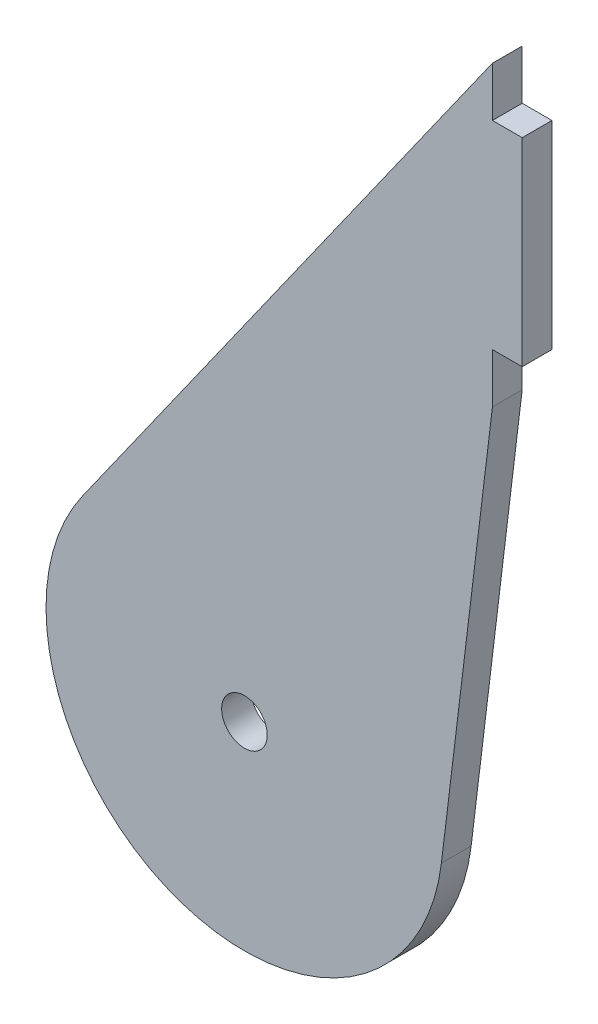
ISO-10303-21;
HEADER;
FILE_DESCRIPTION(('STEP AP214'),'2;1');
FILE_NAME('part.step','',(''),(''),'','','');
FILE_SCHEMA(('AUTOMOTIVE_DESIGN { 1 0 10303 214 1 1 1 1 }'));
ENDSEC;
DATA;
#1=APPLICATION_CONTEXT('core data for automotive mechanical design processes');
#2=APPLICATION_PROTOCOL_DEFINITION('international standard','automotive_design',2000,#1);
#3=PRODUCT_CONTEXT('',#1,'mechanical');
#4=PRODUCT('Part','Part','',(#3));
#5=PRODUCT_RELATED_PRODUCT_CATEGORY('part','',(#4));
#6=PRODUCT_DEFINITION_FORMATION('','',#4);
#7=PRODUCT_DEFINITION_CONTEXT('part definition',#1,'design');
#8=PRODUCT_DEFINITION('design','',#6,#7);
#9=PRODUCT_DEFINITION_SHAPE('','',#8);
#10=(LENGTH_UNIT() NAMED_UNIT(*) SI_UNIT(.MILLI.,.METRE.));
#11=(NAMED_UNIT(*) PLANE_ANGLE_UNIT() SI_UNIT($,.RADIAN.));
#12=(NAMED_UNIT(*) SI_UNIT($,.STERADIAN.) SOLID_ANGLE_UNIT());
#13=UNCERTAINTY_MEASURE_WITH_UNIT(LENGTH_MEASURE(1.E-05),#10,'distance_accuracy_value','');
#14=(GEOMETRIC_REPRESENTATION_CONTEXT(3) GLOBAL_UNCERTAINTY_ASSIGNED_CONTEXT((#13)) GLOBAL_UNIT_ASSIGNED_CONTEXT((#10,
#11,#12)) REPRESENTATION_CONTEXT('',''));
#15=CARTESIAN_POINT('',(0.,0.,0.));
#16=DIRECTION('',(0.,0.,1.));
#17=DIRECTION('',(1.,0.,0.));
#18=AXIS2_PLACEMENT_3D('',#15,#16,#17);
#19=CARTESIAN_POINT('',(25.,70.,-3.));
#20=DIRECTION('',(1.,0.,0.));
#21=DIRECTION('',(0.,1.,0.));
#22=AXIS2_PLACEMENT_3D('',#19,#20,#21);
#23=PLANE('',#22);
#24=DIRECTION('',(0.,0.,1.));
#25=VECTOR('',#24,1.);
#26=CARTESIAN_POINT('',(25.,65.,0.));
#27=LINE('',#26,#25);
#28=CARTESIAN_POINT('',(25.,65.,-3.));
#29=VERTEX_POINT('',#28);
#30=CARTESIAN_POINT('',(25.,65.,0.));
#31=VERTEX_POINT('',#30);
#32=EDGE_CURVE('E49',#29,#31,#27,.T.);
#33=ORIENTED_EDGE('',*,*,#32,.F.);
#34=DIRECTION('',(0.,1.,0.));
#35=VECTOR('',#34,1.);
#36=CARTESIAN_POINT('',(25.,70.,-3.));
#37=LINE('',#36,#35);
#38=CARTESIAN_POINT('',(25.,70.,-3.));
#39=VERTEX_POINT('',#38);
#40=EDGE_CURVE('E155',#29,#39,#37,.T.);
#41=ORIENTED_EDGE('',*,*,#40,.T.);
#42=DIRECTION('',(0.,0.,1.));
#43=VECTOR('',#42,1.);
#44=CARTESIAN_POINT('',(25.,70.,-3.));
#45=LINE('',#44,#43);
#46=CARTESIAN_POINT('',(25.,70.,0.));
#47=VERTEX_POINT('',#46);
#48=EDGE_CURVE('E41',#39,#47,#45,.T.);
#49=ORIENTED_EDGE('',*,*,#48,.T.);
#50=DIRECTION('',(0.,1.,0.));
#51=VECTOR('',#50,1.);
#52=CARTESIAN_POINT('',(25.,70.,0.));
#53=LINE('',#52,#51);
#54=EDGE_CURVE('E54',#31,#47,#53,.T.);
#55=ORIENTED_EDGE('',*,*,#54,.F.);
#56=EDGE_LOOP('',(#33,#41,#49,#55));
#57=FACE_BOUND('',#56,.T.);
#58=ADVANCED_FACE('F32',(#57),#23,.T.);
#59=CARTESIAN_POINT('',(0.,0.,-3.));
#60=DIRECTION('',(0.,0.,1.));
#61=DIRECTION('',(1.,0.,0.));
#62=AXIS2_PLACEMENT_3D('',#59,#60,#61);
#63=CYLINDRICAL_SURFACE('',#62,20.);
#64=CARTESIAN_POINT('',(0.,0.,0.));
#65=DIRECTION('',(0.,0.,1.));
#66=DIRECTION('',(1.,0.,0.));
#67=AXIS2_PLACEMENT_3D('',#64,#65,#66);
#68=CIRCLE('',#67,20.);
#69=CARTESIAN_POINT('',(-16.3302710303954,11.5465253679983,0.));
#70=VERTEX_POINT('',#69);
#71=CARTESIAN_POINT('',(19.854388755627,-2.40899297226689,0.));
#72=VERTEX_POINT('',#71);
#73=EDGE_CURVE('E147',#70,#72,#68,.T.);
#74=ORIENTED_EDGE('',*,*,#73,.F.);
#75=DIRECTION('',(0.,0.,1.));
#76=VECTOR('',#75,1.);
#77=CARTESIAN_POINT('',(-16.3302710303954,11.5465253679983,-3.));
#78=LINE('',#77,#76);
#79=CARTESIAN_POINT('',(-16.3302710303954,11.5465253679983,-3.));
#80=VERTEX_POINT('',#79);
#81=EDGE_CURVE('E11',#80,#70,#78,.T.);
#82=ORIENTED_EDGE('',*,*,#81,.F.);
#83=CARTESIAN_POINT('',(0.,0.,-3.));
#84=DIRECTION('',(0.,0.,1.));
#85=DIRECTION('',(1.,0.,0.));
#86=AXIS2_PLACEMENT_3D('',#83,#84,#85);
#87=CIRCLE('',#86,20.);
#88=CARTESIAN_POINT('',(19.854388755627,-2.40899297226689,-3.));
#89=VERTEX_POINT('',#88);
#90=EDGE_CURVE('E148',#80,#89,#87,.T.);
#91=ORIENTED_EDGE('',*,*,#90,.T.);
#92=DIRECTION('',(0.,0.,1.));
#93=VECTOR('',#92,1.);
#94=CARTESIAN_POINT('',(19.854388755627,-2.40899297226689,-3.));
#95=LINE('',#94,#93);
#96=EDGE_CURVE('E178',#89,#72,#95,.T.);
#97=ORIENTED_EDGE('',*,*,#96,.T.);
#98=EDGE_LOOP('',(#74,#82,#91,#97));
#99=FACE_BOUND('',#98,.T.);
#100=ADVANCED_FACE('F34',(#99),#63,.T.);
#101=CARTESIAN_POINT('',(-16.3302710303954,11.5465253679983,-3.));
#102=DIRECTION('',(-0.816513551519769,0.577326268399917,0.));
#103=DIRECTION('',(-0.577326268399917,-0.816513551519769,0.));
#104=AXIS2_PLACEMENT_3D('',#101,#102,#103);
#105=PLANE('',#104);
#106=DIRECTION('',(-0.577326268399917,-0.816513551519769,0.));
#107=VECTOR('',#106,1.);
#108=CARTESIAN_POINT('',(-16.3302710303954,11.5465253679983,0.));
#109=LINE('',#108,#107);
#110=EDGE_CURVE('E152',#47,#70,#109,.T.);
#111=ORIENTED_EDGE('',*,*,#110,.F.);
#112=ORIENTED_EDGE('',*,*,#48,.F.);
#113=DIRECTION('',(-0.577326268399917,-0.816513551519769,0.));
#114=VECTOR('',#113,1.);
#115=CARTESIAN_POINT('',(-16.3302710303954,11.5465253679983,-3.));
#116=LINE('',#115,#114);
#117=EDGE_CURVE('E158',#39,#80,#116,.T.);
#118=ORIENTED_EDGE('',*,*,#117,.T.);
#119=ORIENTED_EDGE('',*,*,#81,.T.);
#120=EDGE_LOOP('',(#111,#112,#118,#119));
#121=FACE_BOUND('',#120,.T.);
#122=ADVANCED_FACE('F187',(#121),#105,.T.);
#123=DIRECTION('',(0.,0.,-1.));
#124=VECTOR('',#123,1.);
#125=CARTESIAN_POINT('',(25.,45.,0.));
#126=LINE('',#125,#124);
#127=CARTESIAN_POINT('',(25.,45.,0.));
#128=VERTEX_POINT('',#127);
#129=CARTESIAN_POINT('',(25.,45.,-3.));
#130=VERTEX_POINT('',#129);
#131=EDGE_CURVE('E137',#128,#130,#126,.T.);
#132=ORIENTED_EDGE('',*,*,#131,.F.);
#133=CARTESIAN_POINT('',(25.,40.,0.));
#134=VERTEX_POINT('',#133);
#135=EDGE_CURVE('E122',#134,#128,#53,.T.);
#136=ORIENTED_EDGE('',*,*,#135,.F.);
#137=DIRECTION('',(0.,0.,1.));
#138=VECTOR('',#137,1.);
#139=CARTESIAN_POINT('',(25.,40.,-3.));
#140=LINE('',#139,#138);
#141=CARTESIAN_POINT('',(25.,40.,-3.));
#142=VERTEX_POINT('',#141);
#143=EDGE_CURVE('E177',#142,#134,#140,.T.);
#144=ORIENTED_EDGE('',*,*,#143,.F.);
#145=EDGE_CURVE('E164',#142,#130,#37,.T.);
#146=ORIENTED_EDGE('',*,*,#145,.T.);
#147=EDGE_LOOP('',(#132,#136,#144,#146));
#148=FACE_BOUND('',#147,.T.);
#149=ADVANCED_FACE('F197',(#148),#23,.T.);
#150=CARTESIAN_POINT('',(25.,40.,-3.));
#151=DIRECTION('',(0.992719437781351,-0.120449648613344,0.));
#152=DIRECTION('',(0.120449648613344,0.992719437781351,0.));
#153=AXIS2_PLACEMENT_3D('',#150,#151,#152);
#154=PLANE('',#153);
#155=DIRECTION('',(0.120449648613344,0.992719437781351,0.));
#156=VECTOR('',#155,1.);
#157=CARTESIAN_POINT('',(25.,40.,0.));
#158=LINE('',#157,#156);
#159=EDGE_CURVE('E168',#72,#134,#158,.T.);
#160=ORIENTED_EDGE('',*,*,#159,.F.);
#161=ORIENTED_EDGE('',*,*,#96,.F.);
#162=DIRECTION('',(0.120449648613344,0.992719437781351,0.));
#163=VECTOR('',#162,1.);
#164=CARTESIAN_POINT('',(25.,40.,-3.));
#165=LINE('',#164,#163);
#166=EDGE_CURVE('E151',#89,#142,#165,.T.);
#167=ORIENTED_EDGE('',*,*,#166,.T.);
#168=ORIENTED_EDGE('',*,*,#143,.T.);
#169=EDGE_LOOP('',(#160,#161,#167,#168));
#170=FACE_BOUND('',#169,.T.);
#171=ADVANCED_FACE('F203',(#170),#154,.T.);
#172=CARTESIAN_POINT('',(0.,0.,-3.));
#173=DIRECTION('',(0.,0.,1.));
#174=DIRECTION('',(1.,0.,0.));
#175=AXIS2_PLACEMENT_3D('',#172,#173,#174);
#176=PLANE('',#175);
#177=CARTESIAN_POINT('',(0.,0.,-3.));
#178=DIRECTION('',(0.,0.,1.));
#179=DIRECTION('',(1.,0.,0.));
#180=AXIS2_PLACEMENT_3D('',#177,#178,#179);
#181=CIRCLE('',#180,2.3);
#182=CARTESIAN_POINT('',(2.3,0.,-3.));
#183=VERTEX_POINT('',#182);
#184=EDGE_CURVE('E126',#183,#183,#181,.T.);
#185=ORIENTED_EDGE('',*,*,#184,.T.);
#186=EDGE_LOOP('',(#185));
#187=FACE_BOUND('',#186,.T.);
#188=ORIENTED_EDGE('',*,*,#90,.F.);
#189=ORIENTED_EDGE('',*,*,#117,.F.);
#190=ORIENTED_EDGE('',*,*,#40,.F.);
#191=DIRECTION('',(-1.,0.,0.));
#192=VECTOR('',#191,1.);
#193=CARTESIAN_POINT('',(28.,65.,-3.));
#194=LINE('',#193,#192);
#195=CARTESIAN_POINT('',(28.,65.,-3.));
#196=VERTEX_POINT('',#195);
#197=EDGE_CURVE('E128',#196,#29,#194,.T.);
#198=ORIENTED_EDGE('',*,*,#197,.F.);
#199=DIRECTION('',(0.,1.,0.));
#200=VECTOR('',#199,1.);
#201=CARTESIAN_POINT('',(28.,65.,-3.));
#202=LINE('',#201,#200);
#203=CARTESIAN_POINT('',(28.,45.,-3.));
#204=VERTEX_POINT('',#203);
#205=EDGE_CURVE('E106',#204,#196,#202,.T.);
#206=ORIENTED_EDGE('',*,*,#205,.F.);
#207=DIRECTION('',(-1.,0.,0.));
#208=VECTOR('',#207,1.);
#209=CARTESIAN_POINT('',(28.,45.,-3.));
#210=LINE('',#209,#208);
#211=EDGE_CURVE('E103',#204,#130,#210,.T.);
#212=ORIENTED_EDGE('',*,*,#211,.T.);
#213=ORIENTED_EDGE('',*,*,#145,.F.);
#214=ORIENTED_EDGE('',*,*,#166,.F.);
#215=EDGE_LOOP('',(#188,#189,#190,#198,#206,#212,#213,#214));
#216=FACE_BOUND('',#215,.T.);
#217=ADVANCED_FACE('F190',(#187,#216),#176,.F.);
#218=CARTESIAN_POINT('',(0.,0.,0.));
#219=DIRECTION('',(0.,0.,1.));
#220=DIRECTION('',(1.,0.,0.));
#221=AXIS2_PLACEMENT_3D('',#218,#219,#220);
#222=PLANE('',#221);
#223=CARTESIAN_POINT('',(0.,0.,0.));
#224=DIRECTION('',(0.,0.,1.));
#225=DIRECTION('',(1.,0.,0.));
#226=AXIS2_PLACEMENT_3D('',#223,#224,#225);
#227=CIRCLE('',#226,2.3);
#228=CARTESIAN_POINT('',(2.3,0.,0.));
#229=VERTEX_POINT('',#228);
#230=EDGE_CURVE('E123',#229,#229,#227,.T.);
#231=ORIENTED_EDGE('',*,*,#230,.F.);
#232=EDGE_LOOP('',(#231));
#233=FACE_BOUND('',#232,.T.);
#234=ORIENTED_EDGE('',*,*,#73,.T.);
#235=ORIENTED_EDGE('',*,*,#159,.T.);
#236=ORIENTED_EDGE('',*,*,#135,.T.);
#237=DIRECTION('',(-1.,0.,0.));
#238=VECTOR('',#237,1.);
#239=CARTESIAN_POINT('',(28.,45.,0.));
#240=LINE('',#239,#238);
#241=CARTESIAN_POINT('',(28.,45.,0.));
#242=VERTEX_POINT('',#241);
#243=EDGE_CURVE('E101',#242,#128,#240,.T.);
#244=ORIENTED_EDGE('',*,*,#243,.F.);
#245=DIRECTION('',(0.,-1.,0.));
#246=VECTOR('',#245,1.);
#247=CARTESIAN_POINT('',(28.,65.,0.));
#248=LINE('',#247,#246);
#249=CARTESIAN_POINT('',(28.,65.,0.));
#250=VERTEX_POINT('',#249);
#251=EDGE_CURVE('E107',#250,#242,#248,.T.);
#252=ORIENTED_EDGE('',*,*,#251,.F.);
#253=DIRECTION('',(-1.,0.,0.));
#254=VECTOR('',#253,1.);
#255=CARTESIAN_POINT('',(28.,65.,0.));
#256=LINE('',#255,#254);
#257=EDGE_CURVE('E138',#250,#31,#256,.T.);
#258=ORIENTED_EDGE('',*,*,#257,.T.);
#259=ORIENTED_EDGE('',*,*,#54,.T.);
#260=ORIENTED_EDGE('',*,*,#110,.T.);
#261=EDGE_LOOP('',(#234,#235,#236,#244,#252,#258,#259,#260));
#262=FACE_BOUND('',#261,.T.);
#263=ADVANCED_FACE('F119',(#233,#262),#222,.T.);
#264=CARTESIAN_POINT('',(0.,0.,-10.));
#265=DIRECTION('',(0.,0.,1.));
#266=DIRECTION('',(1.,0.,0.));
#267=AXIS2_PLACEMENT_3D('',#264,#265,#266);
#268=CYLINDRICAL_SURFACE('',#267,2.3);
#269=ORIENTED_EDGE('',*,*,#230,.T.);
#270=EDGE_LOOP('',(#269));
#271=FACE_BOUND('',#270,.T.);
#272=ORIENTED_EDGE('',*,*,#184,.F.);
#273=EDGE_LOOP('',(#272));
#274=FACE_BOUND('',#273,.T.);
#275=ADVANCED_FACE('F221',(#271,#274),#268,.F.);
#276=CARTESIAN_POINT('',(28.,45.,0.));
#277=DIRECTION('',(0.,1.,0.));
#278=DIRECTION('',(-1.,0.,0.));
#279=AXIS2_PLACEMENT_3D('',#276,#277,#278);
#280=PLANE('',#279);
#281=ORIENTED_EDGE('',*,*,#131,.T.);
#282=ORIENTED_EDGE('',*,*,#211,.F.);
#283=DIRECTION('',(0.,0.,-1.));
#284=VECTOR('',#283,1.);
#285=CARTESIAN_POINT('',(28.,45.,0.));
#286=LINE('',#285,#284);
#287=EDGE_CURVE('E96',#242,#204,#286,.T.);
#288=ORIENTED_EDGE('',*,*,#287,.F.);
#289=ORIENTED_EDGE('',*,*,#243,.T.);
#290=EDGE_LOOP('',(#281,#282,#288,#289));
#291=FACE_BOUND('',#290,.T.);
#292=ADVANCED_FACE('F99',(#291),#280,.F.);
#293=CARTESIAN_POINT('',(28.,65.,0.));
#294=DIRECTION('',(0.,-1.,0.));
#295=DIRECTION('',(1.,0.,0.));
#296=AXIS2_PLACEMENT_3D('',#293,#294,#295);
#297=PLANE('',#296);
#298=ORIENTED_EDGE('',*,*,#32,.T.);
#299=ORIENTED_EDGE('',*,*,#257,.F.);
#300=DIRECTION('',(0.,0.,1.));
#301=VECTOR('',#300,1.);
#302=CARTESIAN_POINT('',(28.,65.,0.));
#303=LINE('',#302,#301);
#304=EDGE_CURVE('E112',#196,#250,#303,.T.);
#305=ORIENTED_EDGE('',*,*,#304,.F.);
#306=ORIENTED_EDGE('',*,*,#197,.T.);
#307=EDGE_LOOP('',(#298,#299,#305,#306));
#308=FACE_BOUND('',#307,.T.);
#309=ADVANCED_FACE('F213',(#308),#297,.F.);
#310=CARTESIAN_POINT('',(28.,0.,0.));
#311=DIRECTION('',(1.,0.,0.));
#312=DIRECTION('',(0.,1.,0.));
#313=AXIS2_PLACEMENT_3D('',#310,#311,#312);
#314=PLANE('',#313);
#315=ORIENTED_EDGE('',*,*,#251,.T.);
#316=ORIENTED_EDGE('',*,*,#287,.T.);
#317=ORIENTED_EDGE('',*,*,#205,.T.);
#318=ORIENTED_EDGE('',*,*,#304,.T.);
#319=EDGE_LOOP('',(#315,#316,#317,#318));
#320=FACE_BOUND('',#319,.T.);
#321=ADVANCED_FACE('F110',(#320),#314,.T.);
#322=CLOSED_SHELL('',(#58,#100,#122,#149,#171,#217,#263,#275,#292,#309,#321));
#323=MANIFOLD_SOLID_BREP('B2',#322);
#324=ADVANCED_BREP_SHAPE_REPRESENTATION('',(#18,#323),#14);
#325=SHAPE_DEFINITION_REPRESENTATION(#9,#324);
ENDSEC;
END-ISO-10303-21;
